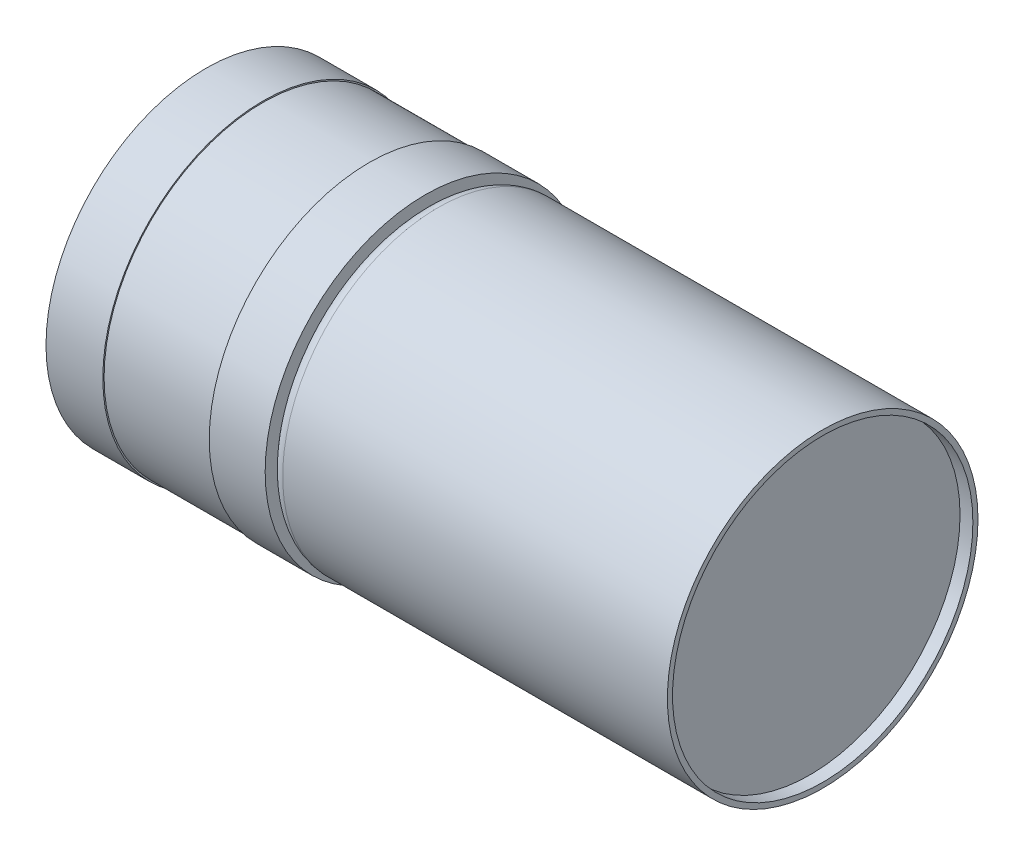
ISO-10303-21;
HEADER;
FILE_DESCRIPTION(('STEP AP214'),'2;1');
FILE_NAME('part.step','',(''),(''),'','','');
FILE_SCHEMA(('AUTOMOTIVE_DESIGN { 1 0 10303 214 1 1 1 1 }'));
ENDSEC;
DATA;
#1=APPLICATION_CONTEXT('core data for automotive mechanical design processes');
#2=APPLICATION_PROTOCOL_DEFINITION('international standard','automotive_design',2000,#1);
#3=PRODUCT_CONTEXT('',#1,'mechanical');
#4=PRODUCT('Part','Part','',(#3));
#5=PRODUCT_RELATED_PRODUCT_CATEGORY('part','',(#4));
#6=PRODUCT_DEFINITION_FORMATION('','',#4);
#7=PRODUCT_DEFINITION_CONTEXT('part definition',#1,'design');
#8=PRODUCT_DEFINITION('design','',#6,#7);
#9=PRODUCT_DEFINITION_SHAPE('','',#8);
#10=(LENGTH_UNIT() NAMED_UNIT(*) SI_UNIT(.MILLI.,.METRE.));
#11=(NAMED_UNIT(*) PLANE_ANGLE_UNIT() SI_UNIT($,.RADIAN.));
#12=(NAMED_UNIT(*) SI_UNIT($,.STERADIAN.) SOLID_ANGLE_UNIT());
#13=UNCERTAINTY_MEASURE_WITH_UNIT(LENGTH_MEASURE(1.E-05),#10,'distance_accuracy_value','');
#14=(GEOMETRIC_REPRESENTATION_CONTEXT(3) GLOBAL_UNCERTAINTY_ASSIGNED_CONTEXT((#13)) GLOBAL_UNIT_ASSIGNED_CONTEXT((#10,
#11,#12)) REPRESENTATION_CONTEXT('',''));
#15=CARTESIAN_POINT('',(0.,0.,0.));
#16=DIRECTION('',(0.,0.,1.));
#17=DIRECTION('',(1.,0.,0.));
#18=AXIS2_PLACEMENT_3D('',#15,#16,#17);
#19=CARTESIAN_POINT('',(31.,0.,0.));
#20=DIRECTION('',(-1.,0.,0.));
#21=DIRECTION('',(0.,0.,1.));
#22=AXIS2_PLACEMENT_3D('',#19,#20,#21);
#23=CYLINDRICAL_SURFACE('',#22,12.11);
#24=CARTESIAN_POINT('',(1.,0.,0.));
#25=DIRECTION('',(1.,0.,0.));
#26=DIRECTION('',(0.,0.,-1.));
#27=AXIS2_PLACEMENT_3D('',#24,#25,#26);
#28=CIRCLE('',#27,12.11);
#29=CARTESIAN_POINT('',(1.,0.,-12.11));
#30=VERTEX_POINT('',#29);
#31=EDGE_CURVE('E38',#30,#30,#28,.T.);
#32=ORIENTED_EDGE('',*,*,#31,.T.);
#33=EDGE_LOOP('',(#32));
#34=FACE_BOUND('',#33,.T.);
#35=CARTESIAN_POINT('',(31.,0.,0.));
#36=DIRECTION('',(1.,0.,0.));
#37=DIRECTION('',(0.,0.,-1.));
#38=AXIS2_PLACEMENT_3D('',#35,#36,#37);
#39=CIRCLE('',#38,12.11);
#40=CARTESIAN_POINT('',(31.,0.,-12.11));
#41=VERTEX_POINT('',#40);
#42=EDGE_CURVE('E42',#41,#41,#39,.T.);
#43=ORIENTED_EDGE('',*,*,#42,.F.);
#44=EDGE_LOOP('',(#43));
#45=FACE_BOUND('',#44,.T.);
#46=ADVANCED_FACE('F31',(#34,#45),#23,.T.);
#47=CARTESIAN_POINT('',(31.,0.,0.));
#48=DIRECTION('',(1.,0.,0.));
#49=DIRECTION('',(0.,0.,-1.));
#50=AXIS2_PLACEMENT_3D('',#47,#48,#49);
#51=PLANE('',#50);
#52=CARTESIAN_POINT('',(31.,0.,0.));
#53=DIRECTION('',(1.,0.,0.));
#54=DIRECTION('',(0.,0.,-1.));
#55=AXIS2_PLACEMENT_3D('',#52,#53,#54);
#56=CIRCLE('',#55,11.71);
#57=CARTESIAN_POINT('',(31.,0.,-11.71));
#58=VERTEX_POINT('',#57);
#59=EDGE_CURVE('E49',#58,#58,#56,.T.);
#60=ORIENTED_EDGE('',*,*,#59,.F.);
#61=EDGE_LOOP('',(#60));
#62=FACE_BOUND('',#61,.T.);
#63=ORIENTED_EDGE('',*,*,#42,.T.);
#64=EDGE_LOOP('',(#63));
#65=FACE_BOUND('',#64,.T.);
#66=ADVANCED_FACE('F120',(#62,#65),#51,.T.);
#67=CARTESIAN_POINT('',(1.,0.,0.));
#68=DIRECTION('',(1.,0.,0.));
#69=DIRECTION('',(0.,0.,-1.));
#70=AXIS2_PLACEMENT_3D('',#67,#68,#69);
#71=TOROIDAL_SURFACE('',#70,11.11,1.);
#72=CARTESIAN_POINT('',(0.,0.,0.));
#73=DIRECTION('',(1.,0.,0.));
#74=DIRECTION('',(0.,0.,-1.));
#75=AXIS2_PLACEMENT_3D('',#72,#73,#74);
#76=CIRCLE('',#75,11.11);
#77=CARTESIAN_POINT('',(0.,0.,-11.11));
#78=VERTEX_POINT('',#77);
#79=EDGE_CURVE('E10',#78,#78,#76,.F.);
#80=ORIENTED_EDGE('',*,*,#79,.F.);
#81=EDGE_LOOP('',(#80));
#82=FACE_BOUND('',#81,.T.);
#83=ORIENTED_EDGE('',*,*,#31,.F.);
#84=EDGE_LOOP('',(#83));
#85=FACE_BOUND('',#84,.T.);
#86=ADVANCED_FACE('F33',(#82,#85),#71,.T.);
#87=CARTESIAN_POINT('',(30.,0.,0.));
#88=DIRECTION('',(1.,0.,0.));
#89=DIRECTION('',(0.,0.,-1.));
#90=AXIS2_PLACEMENT_3D('',#87,#88,#89);
#91=CYLINDRICAL_SURFACE('',#90,11.71);
#92=CARTESIAN_POINT('',(30.,0.,0.));
#93=DIRECTION('',(1.,0.,0.));
#94=DIRECTION('',(0.,0.,-1.));
#95=AXIS2_PLACEMENT_3D('',#92,#93,#94);
#96=CIRCLE('',#95,11.71);
#97=CARTESIAN_POINT('',(30.,0.,-11.71));
#98=VERTEX_POINT('',#97);
#99=EDGE_CURVE('E46',#98,#98,#96,.T.);
#100=ORIENTED_EDGE('',*,*,#99,.F.);
#101=EDGE_LOOP('',(#100));
#102=FACE_BOUND('',#101,.T.);
#103=ORIENTED_EDGE('',*,*,#59,.T.);
#104=EDGE_LOOP('',(#103));
#105=FACE_BOUND('',#104,.T.);
#106=ADVANCED_FACE('F128',(#102,#105),#91,.F.);
#107=CARTESIAN_POINT('',(30.,0.,0.));
#108=DIRECTION('',(1.,0.,0.));
#109=DIRECTION('',(0.,0.,-1.));
#110=AXIS2_PLACEMENT_3D('',#107,#108,#109);
#111=PLANE('',#110);
#112=ORIENTED_EDGE('',*,*,#99,.T.);
#113=EDGE_LOOP('',(#112));
#114=FACE_BOUND('',#113,.T.);
#115=ADVANCED_FACE('F131',(#114),#111,.T.);
#116=CARTESIAN_POINT('',(-4.36,0.,0.));
#117=DIRECTION('',(1.,0.,0.));
#118=DIRECTION('',(0.,0.,-1.));
#119=AXIS2_PLACEMENT_3D('',#116,#117,#118);
#120=CYLINDRICAL_SURFACE('',#119,12.475);
#121=CARTESIAN_POINT('',(-4.36,0.,0.));
#122=DIRECTION('',(-1.,0.,0.));
#123=DIRECTION('',(0.,0.,1.));
#124=AXIS2_PLACEMENT_3D('',#121,#122,#123);
#125=CIRCLE('',#124,12.475);
#126=CARTESIAN_POINT('',(-4.36,0.,12.475));
#127=VERTEX_POINT('',#126);
#128=EDGE_CURVE('E52',#127,#127,#125,.T.);
#129=ORIENTED_EDGE('',*,*,#128,.F.);
#130=EDGE_LOOP('',(#129));
#131=FACE_BOUND('',#130,.T.);
#132=CARTESIAN_POINT('',(0.,0.,0.));
#133=DIRECTION('',(-1.,0.,0.));
#134=DIRECTION('',(0.,0.,1.));
#135=AXIS2_PLACEMENT_3D('',#132,#133,#134);
#136=CIRCLE('',#135,12.475);
#137=CARTESIAN_POINT('',(0.,0.,12.475));
#138=VERTEX_POINT('',#137);
#139=EDGE_CURVE('E55',#138,#138,#136,.T.);
#140=ORIENTED_EDGE('',*,*,#139,.T.);
#141=EDGE_LOOP('',(#140));
#142=FACE_BOUND('',#141,.T.);
#143=ADVANCED_FACE('F135',(#131,#142),#120,.T.);
#144=CARTESIAN_POINT('',(-4.36,0.,0.));
#145=DIRECTION('',(-1.,0.,0.));
#146=DIRECTION('',(0.,0.,1.));
#147=AXIS2_PLACEMENT_3D('',#144,#145,#146);
#148=PLANE('',#147);
#149=CARTESIAN_POINT('',(-4.36,0.,0.));
#150=DIRECTION('',(-1.,0.,0.));
#151=DIRECTION('',(0.,0.,1.));
#152=AXIS2_PLACEMENT_3D('',#149,#150,#151);
#153=CIRCLE('',#152,12.375);
#154=CARTESIAN_POINT('',(-4.36,0.,12.375));
#155=VERTEX_POINT('',#154);
#156=EDGE_CURVE('E61',#155,#155,#153,.T.);
#157=ORIENTED_EDGE('',*,*,#156,.F.);
#158=EDGE_LOOP('',(#157));
#159=FACE_BOUND('',#158,.T.);
#160=ORIENTED_EDGE('',*,*,#128,.T.);
#161=EDGE_LOOP('',(#160));
#162=FACE_BOUND('',#161,.T.);
#163=ADVANCED_FACE('F139',(#159,#162),#148,.T.);
#164=CARTESIAN_POINT('',(0.,0.,0.));
#165=DIRECTION('',(-1.,0.,0.));
#166=DIRECTION('',(0.,0.,1.));
#167=AXIS2_PLACEMENT_3D('',#164,#165,#166);
#168=PLANE('',#167);
#169=ORIENTED_EDGE('',*,*,#79,.T.);
#170=EDGE_LOOP('',(#169));
#171=FACE_BOUND('',#170,.T.);
#172=ORIENTED_EDGE('',*,*,#139,.F.);
#173=EDGE_LOOP('',(#172));
#174=FACE_BOUND('',#173,.T.);
#175=ADVANCED_FACE('F141',(#171,#174),#168,.F.);
#176=CARTESIAN_POINT('',(-12.66,0.,0.));
#177=DIRECTION('',(1.,0.,0.));
#178=DIRECTION('',(0.,0.,-1.));
#179=AXIS2_PLACEMENT_3D('',#176,#177,#178);
#180=CYLINDRICAL_SURFACE('',#179,12.375);
#181=CARTESIAN_POINT('',(-12.66,0.,0.));
#182=DIRECTION('',(-1.,0.,0.));
#183=DIRECTION('',(0.,0.,1.));
#184=AXIS2_PLACEMENT_3D('',#181,#182,#183);
#185=CIRCLE('',#184,12.375);
#186=CARTESIAN_POINT('',(-12.66,0.,12.375));
#187=VERTEX_POINT('',#186);
#188=EDGE_CURVE('E58',#187,#187,#185,.T.);
#189=ORIENTED_EDGE('',*,*,#188,.F.);
#190=EDGE_LOOP('',(#189));
#191=FACE_BOUND('',#190,.T.);
#192=ORIENTED_EDGE('',*,*,#156,.T.);
#193=EDGE_LOOP('',(#192));
#194=FACE_BOUND('',#193,.T.);
#195=ADVANCED_FACE('F106',(#191,#194),#180,.T.);
#196=CARTESIAN_POINT('',(-17.09,0.,0.));
#197=DIRECTION('',(1.,0.,0.));
#198=DIRECTION('',(0.,0.,-1.));
#199=AXIS2_PLACEMENT_3D('',#196,#197,#198);
#200=CYLINDRICAL_SURFACE('',#199,12.475);
#201=CARTESIAN_POINT('',(-17.09,0.,0.));
#202=DIRECTION('',(-1.,0.,0.));
#203=DIRECTION('',(0.,0.,1.));
#204=AXIS2_PLACEMENT_3D('',#201,#202,#203);
#205=CIRCLE('',#204,12.475);
#206=CARTESIAN_POINT('',(-17.09,0.,12.475));
#207=VERTEX_POINT('',#206);
#208=EDGE_CURVE('E64',#207,#207,#205,.T.);
#209=ORIENTED_EDGE('',*,*,#208,.F.);
#210=EDGE_LOOP('',(#209));
#211=FACE_BOUND('',#210,.T.);
#212=CARTESIAN_POINT('',(-12.66,0.,0.));
#213=DIRECTION('',(-1.,0.,0.));
#214=DIRECTION('',(0.,0.,1.));
#215=AXIS2_PLACEMENT_3D('',#212,#213,#214);
#216=CIRCLE('',#215,12.475);
#217=CARTESIAN_POINT('',(-12.66,0.,12.475));
#218=VERTEX_POINT('',#217);
#219=EDGE_CURVE('E67',#218,#218,#216,.T.);
#220=ORIENTED_EDGE('',*,*,#219,.T.);
#221=EDGE_LOOP('',(#220));
#222=FACE_BOUND('',#221,.T.);
#223=ADVANCED_FACE('F98',(#211,#222),#200,.T.);
#224=CARTESIAN_POINT('',(-17.09,0.,0.));
#225=DIRECTION('',(-1.,0.,0.));
#226=DIRECTION('',(0.,0.,1.));
#227=AXIS2_PLACEMENT_3D('',#224,#225,#226);
#228=PLANE('',#227);
#229=CARTESIAN_POINT('',(-17.09,-8.5,0.));
#230=DIRECTION('',(-1.,0.,0.));
#231=DIRECTION('',(0.,0.,-1.));
#232=AXIS2_PLACEMENT_3D('',#229,#230,#231);
#233=CIRCLE('',#232,1.4);
#234=CARTESIAN_POINT('',(-17.09,-8.5,-1.4));
#235=VERTEX_POINT('',#234);
#236=EDGE_CURVE('E79',#235,#235,#233,.T.);
#237=ORIENTED_EDGE('',*,*,#236,.F.);
#238=EDGE_LOOP('',(#237));
#239=FACE_BOUND('',#238,.T.);
#240=CARTESIAN_POINT('',(-17.09,8.5,0.));
#241=DIRECTION('',(-1.,0.,0.));
#242=DIRECTION('',(0.,0.,1.));
#243=AXIS2_PLACEMENT_3D('',#240,#241,#242);
#244=CIRCLE('',#243,1.4);
#245=CARTESIAN_POINT('',(-17.09,8.5,1.4));
#246=VERTEX_POINT('',#245);
#247=EDGE_CURVE('E73',#246,#246,#244,.T.);
#248=ORIENTED_EDGE('',*,*,#247,.F.);
#249=EDGE_LOOP('',(#248));
#250=FACE_BOUND('',#249,.T.);
#251=ORIENTED_EDGE('',*,*,#208,.T.);
#252=EDGE_LOOP('',(#251));
#253=FACE_BOUND('',#252,.T.);
#254=ADVANCED_FACE('F94',(#239,#250,#253),#228,.T.);
#255=CARTESIAN_POINT('',(-12.66,0.,0.));
#256=DIRECTION('',(-1.,0.,0.));
#257=DIRECTION('',(0.,0.,1.));
#258=AXIS2_PLACEMENT_3D('',#255,#256,#257);
#259=PLANE('',#258);
#260=ORIENTED_EDGE('',*,*,#188,.T.);
#261=EDGE_LOOP('',(#260));
#262=FACE_BOUND('',#261,.T.);
#263=ORIENTED_EDGE('',*,*,#219,.F.);
#264=EDGE_LOOP('',(#263));
#265=FACE_BOUND('',#264,.T.);
#266=ADVANCED_FACE('F97',(#262,#265),#259,.F.);
#267=CARTESIAN_POINT('',(-11.09,8.5,0.));
#268=DIRECTION('',(-1.,0.,0.));
#269=DIRECTION('',(0.,0.,1.));
#270=AXIS2_PLACEMENT_3D('',#267,#268,#269);
#271=CYLINDRICAL_SURFACE('',#270,1.4);
#272=CARTESIAN_POINT('',(-11.09,8.5,0.));
#273=DIRECTION('',(-1.,0.,0.));
#274=DIRECTION('',(0.,0.,1.));
#275=AXIS2_PLACEMENT_3D('',#272,#273,#274);
#276=CIRCLE('',#275,1.4);
#277=CARTESIAN_POINT('',(-11.09,8.5,1.4));
#278=VERTEX_POINT('',#277);
#279=EDGE_CURVE('E70',#278,#278,#276,.T.);
#280=ORIENTED_EDGE('',*,*,#279,.F.);
#281=EDGE_LOOP('',(#280));
#282=FACE_BOUND('',#281,.T.);
#283=ORIENTED_EDGE('',*,*,#247,.T.);
#284=EDGE_LOOP('',(#283));
#285=FACE_BOUND('',#284,.T.);
#286=ADVANCED_FACE('F111',(#282,#285),#271,.F.);
#287=CARTESIAN_POINT('',(-11.09,8.5,0.));
#288=DIRECTION('',(-1.,0.,0.));
#289=DIRECTION('',(0.,0.,1.));
#290=AXIS2_PLACEMENT_3D('',#287,#288,#289);
#291=PLANE('',#290);
#292=ORIENTED_EDGE('',*,*,#279,.T.);
#293=EDGE_LOOP('',(#292));
#294=FACE_BOUND('',#293,.T.);
#295=ADVANCED_FACE('F90',(#294),#291,.T.);
#296=CARTESIAN_POINT('',(-11.09,-8.5,0.));
#297=DIRECTION('',(-1.,0.,0.));
#298=DIRECTION('',(0.,0.,1.));
#299=AXIS2_PLACEMENT_3D('',#296,#297,#298);
#300=CYLINDRICAL_SURFACE('',#299,1.4);
#301=CARTESIAN_POINT('',(-11.09,-8.5,0.));
#302=DIRECTION('',(-1.,0.,0.));
#303=DIRECTION('',(0.,0.,-1.));
#304=AXIS2_PLACEMENT_3D('',#301,#302,#303);
#305=CIRCLE('',#304,1.4);
#306=CARTESIAN_POINT('',(-11.09,-8.5,-1.4));
#307=VERTEX_POINT('',#306);
#308=EDGE_CURVE('E76',#307,#307,#305,.T.);
#309=ORIENTED_EDGE('',*,*,#308,.F.);
#310=EDGE_LOOP('',(#309));
#311=FACE_BOUND('',#310,.T.);
#312=ORIENTED_EDGE('',*,*,#236,.T.);
#313=EDGE_LOOP('',(#312));
#314=FACE_BOUND('',#313,.T.);
#315=ADVANCED_FACE('F87',(#311,#314),#300,.F.);
#316=CARTESIAN_POINT('',(-11.09,-8.5,0.));
#317=DIRECTION('',(1.,0.,0.));
#318=DIRECTION('',(0.,0.,-1.));
#319=AXIS2_PLACEMENT_3D('',#316,#317,#318);
#320=PLANE('',#319);
#321=ORIENTED_EDGE('',*,*,#308,.T.);
#322=EDGE_LOOP('',(#321));
#323=FACE_BOUND('',#322,.T.);
#324=ADVANCED_FACE('F85',(#323),#320,.F.);
#325=CLOSED_SHELL('',(#46,#66,#86,#106,#115,#143,#163,#175,#195,#223,#254,#266,#286,#295,#315,#324));
#326=MANIFOLD_SOLID_BREP('B2',#325);
#327=ADVANCED_BREP_SHAPE_REPRESENTATION('',(#18,#326),#14);
#328=SHAPE_DEFINITION_REPRESENTATION(#9,#327);
ENDSEC;
END-ISO-10303-21;
